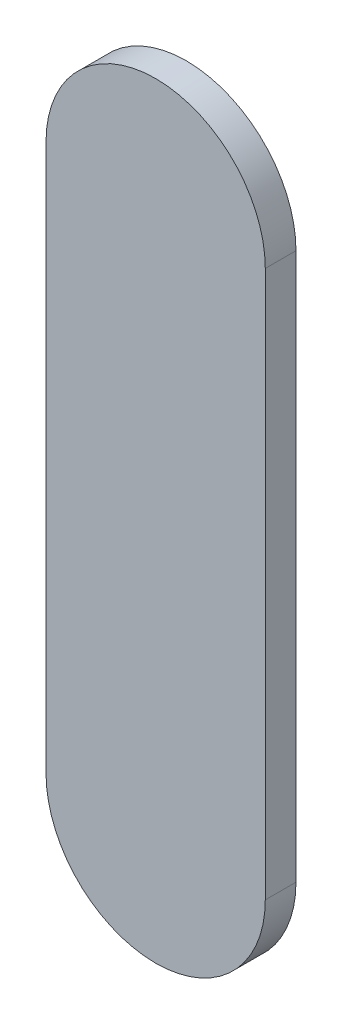
ISO-10303-21;
HEADER;
FILE_DESCRIPTION(('STEP AP214'),'2;1');
FILE_NAME('part.step','',(''),(''),'','','');
FILE_SCHEMA(('AUTOMOTIVE_DESIGN { 1 0 10303 214 1 1 1 1 }'));
ENDSEC;
DATA;
#1=APPLICATION_CONTEXT('core data for automotive mechanical design processes');
#2=APPLICATION_PROTOCOL_DEFINITION('international standard','automotive_design',2000,#1);
#3=PRODUCT_CONTEXT('',#1,'mechanical');
#4=PRODUCT('Part','Part','',(#3));
#5=PRODUCT_RELATED_PRODUCT_CATEGORY('part','',(#4));
#6=PRODUCT_DEFINITION_FORMATION('','',#4);
#7=PRODUCT_DEFINITION_CONTEXT('part definition',#1,'design');
#8=PRODUCT_DEFINITION('design','',#6,#7);
#9=PRODUCT_DEFINITION_SHAPE('','',#8);
#10=(LENGTH_UNIT() NAMED_UNIT(*) SI_UNIT(.MILLI.,.METRE.));
#11=(NAMED_UNIT(*) PLANE_ANGLE_UNIT() SI_UNIT($,.RADIAN.));
#12=(NAMED_UNIT(*) SI_UNIT($,.STERADIAN.) SOLID_ANGLE_UNIT());
#13=UNCERTAINTY_MEASURE_WITH_UNIT(LENGTH_MEASURE(1.E-05),#10,'distance_accuracy_value','');
#14=(GEOMETRIC_REPRESENTATION_CONTEXT(3) GLOBAL_UNCERTAINTY_ASSIGNED_CONTEXT((#13)) GLOBAL_UNIT_ASSIGNED_CONTEXT((#10,
#11,#12)) REPRESENTATION_CONTEXT('',''));
#15=CARTESIAN_POINT('',(0.,0.,0.));
#16=DIRECTION('',(0.,0.,1.));
#17=DIRECTION('',(1.,0.,0.));
#18=AXIS2_PLACEMENT_3D('',#15,#16,#17);
#19=CARTESIAN_POINT('',(87.7480084,92.25726024,0.));
#20=DIRECTION('',(-1.,0.,0.));
#21=DIRECTION('',(0.,1.,0.));
#22=AXIS2_PLACEMENT_3D('',#19,#20,#21);
#23=PLANE('',#22);
#24=DIRECTION('',(0.,1.,0.));
#25=VECTOR('',#24,1.);
#26=CARTESIAN_POINT('',(87.7480084,92.25726024,0.03556));
#27=LINE('',#26,#25);
#28=CARTESIAN_POINT('',(87.7480084,92.25726024,0.03556));
#29=VERTEX_POINT('',#28);
#30=CARTESIAN_POINT('',(87.7480084,92.89075656,0.03556));
#31=VERTEX_POINT('',#30);
#32=EDGE_CURVE('E11',#29,#31,#27,.T.);
#33=ORIENTED_EDGE('',*,*,#32,.F.);
#34=DIRECTION('',(0.,0.,1.));
#35=VECTOR('',#34,1.);
#36=CARTESIAN_POINT('',(87.7480084,92.25726024,0.));
#37=LINE('',#36,#35);
#38=CARTESIAN_POINT('',(87.7480084,92.25726024,0.));
#39=VERTEX_POINT('',#38);
#40=EDGE_CURVE('E24',#39,#29,#37,.T.);
#41=ORIENTED_EDGE('',*,*,#40,.F.);
#42=DIRECTION('',(0.,1.,0.));
#43=VECTOR('',#42,1.);
#44=CARTESIAN_POINT('',(87.7480084,92.25726024,0.));
#45=LINE('',#44,#43);
#46=CARTESIAN_POINT('',(87.7480084,92.89075656,0.));
#47=VERTEX_POINT('',#46);
#48=EDGE_CURVE('E75',#39,#47,#45,.T.);
#49=ORIENTED_EDGE('',*,*,#48,.T.);
#50=DIRECTION('',(0.,0.,1.));
#51=VECTOR('',#50,1.);
#52=CARTESIAN_POINT('',(87.7480084,92.89075656,0.));
#53=LINE('',#52,#51);
#54=EDGE_CURVE('E37',#47,#31,#53,.T.);
#55=ORIENTED_EDGE('',*,*,#54,.T.);
#56=EDGE_LOOP('',(#33,#41,#49,#55));
#57=FACE_BOUND('',#56,.T.);
#58=ADVANCED_FACE('F17',(#57),#23,.F.);
#59=CARTESIAN_POINT('',(87.6210084,92.89075656,0.));
#60=DIRECTION('',(0.,0.,-1.));
#61=DIRECTION('',(1.,0.,0.));
#62=AXIS2_PLACEMENT_3D('',#59,#60,#61);
#63=CYLINDRICAL_SURFACE('',#62,0.126999999999995);
#64=CARTESIAN_POINT('',(87.6210084,92.89075656,0.03556));
#65=DIRECTION('',(0.,0.,1.));
#66=DIRECTION('',(1.,0.,0.));
#67=AXIS2_PLACEMENT_3D('',#64,#65,#66);
#68=CIRCLE('',#67,0.126999999999995);
#69=CARTESIAN_POINT('',(87.4940084,92.89075656,0.03556));
#70=VERTEX_POINT('',#69);
#71=EDGE_CURVE('E83',#31,#70,#68,.T.);
#72=ORIENTED_EDGE('',*,*,#71,.F.);
#73=ORIENTED_EDGE('',*,*,#54,.F.);
#74=CARTESIAN_POINT('',(87.6210084,92.89075656,0.));
#75=DIRECTION('',(0.,0.,1.));
#76=DIRECTION('',(1.,0.,0.));
#77=AXIS2_PLACEMENT_3D('',#74,#75,#76);
#78=CIRCLE('',#77,0.126999999999995);
#79=CARTESIAN_POINT('',(87.4940084,92.89075656,0.));
#80=VERTEX_POINT('',#79);
#81=EDGE_CURVE('E81',#47,#80,#78,.T.);
#82=ORIENTED_EDGE('',*,*,#81,.T.);
#83=DIRECTION('',(0.,0.,1.));
#84=VECTOR('',#83,1.);
#85=CARTESIAN_POINT('',(87.4940084,92.89075656,0.));
#86=LINE('',#85,#84);
#87=EDGE_CURVE('E67',#80,#70,#86,.T.);
#88=ORIENTED_EDGE('',*,*,#87,.T.);
#89=EDGE_LOOP('',(#72,#73,#82,#88));
#90=FACE_BOUND('',#89,.T.);
#91=ADVANCED_FACE('F89',(#90),#63,.T.);
#92=CARTESIAN_POINT('',(87.4940084,92.89075656,0.));
#93=DIRECTION('',(1.,0.,0.));
#94=DIRECTION('',(0.,-1.,0.));
#95=AXIS2_PLACEMENT_3D('',#92,#93,#94);
#96=PLANE('',#95);
#97=DIRECTION('',(0.,-1.,0.));
#98=VECTOR('',#97,1.);
#99=CARTESIAN_POINT('',(87.4940084,92.89075656,0.03556));
#100=LINE('',#99,#98);
#101=CARTESIAN_POINT('',(87.4940084,92.25726024,0.03556));
#102=VERTEX_POINT('',#101);
#103=EDGE_CURVE('E71',#70,#102,#100,.T.);
#104=ORIENTED_EDGE('',*,*,#103,.F.);
#105=ORIENTED_EDGE('',*,*,#87,.F.);
#106=DIRECTION('',(0.,-1.,0.));
#107=VECTOR('',#106,1.);
#108=CARTESIAN_POINT('',(87.4940084,92.89075656,0.));
#109=LINE('',#108,#107);
#110=CARTESIAN_POINT('',(87.4940084,92.25726024,0.));
#111=VERTEX_POINT('',#110);
#112=EDGE_CURVE('E63',#80,#111,#109,.T.);
#113=ORIENTED_EDGE('',*,*,#112,.T.);
#114=DIRECTION('',(0.,0.,1.));
#115=VECTOR('',#114,1.);
#116=CARTESIAN_POINT('',(87.4940084,92.25726024,0.));
#117=LINE('',#116,#115);
#118=EDGE_CURVE('E53',#111,#102,#117,.T.);
#119=ORIENTED_EDGE('',*,*,#118,.T.);
#120=EDGE_LOOP('',(#104,#105,#113,#119));
#121=FACE_BOUND('',#120,.T.);
#122=ADVANCED_FACE('F66',(#121),#96,.F.);
#123=CARTESIAN_POINT('',(87.6210084,92.25726024,0.));
#124=DIRECTION('',(0.,0.,-1.));
#125=DIRECTION('',(-1.,0.,0.));
#126=AXIS2_PLACEMENT_3D('',#123,#124,#125);
#127=CYLINDRICAL_SURFACE('',#126,0.126999999999995);
#128=CARTESIAN_POINT('',(87.6210084,92.25726024,0.03556));
#129=DIRECTION('',(0.,0.,1.));
#130=DIRECTION('',(-1.,0.,0.));
#131=AXIS2_PLACEMENT_3D('',#128,#129,#130);
#132=CIRCLE('',#131,0.126999999999995);
#133=EDGE_CURVE('E59',#102,#29,#132,.T.);
#134=ORIENTED_EDGE('',*,*,#133,.F.);
#135=ORIENTED_EDGE('',*,*,#118,.F.);
#136=CARTESIAN_POINT('',(87.6210084,92.25726024,0.));
#137=DIRECTION('',(0.,0.,1.));
#138=DIRECTION('',(-1.,0.,0.));
#139=AXIS2_PLACEMENT_3D('',#136,#137,#138);
#140=CIRCLE('',#139,0.126999999999995);
#141=EDGE_CURVE('E57',#111,#39,#140,.T.);
#142=ORIENTED_EDGE('',*,*,#141,.T.);
#143=ORIENTED_EDGE('',*,*,#40,.T.);
#144=EDGE_LOOP('',(#134,#135,#142,#143));
#145=FACE_BOUND('',#144,.T.);
#146=ADVANCED_FACE('F55',(#145),#127,.T.);
#147=CARTESIAN_POINT('',(87.7480084,92.25726024,0.));
#148=DIRECTION('',(0.,0.,-1.));
#149=DIRECTION('',(-1.,0.,0.));
#150=AXIS2_PLACEMENT_3D('',#147,#148,#149);
#151=PLANE('',#150);
#152=ORIENTED_EDGE('',*,*,#141,.F.);
#153=ORIENTED_EDGE('',*,*,#112,.F.);
#154=ORIENTED_EDGE('',*,*,#81,.F.);
#155=ORIENTED_EDGE('',*,*,#48,.F.);
#156=EDGE_LOOP('',(#152,#153,#154,#155));
#157=FACE_BOUND('',#156,.T.);
#158=ADVANCED_FACE('F74',(#157),#151,.T.);
#159=CARTESIAN_POINT('',(87.7480084,92.25726024,0.03556));
#160=DIRECTION('',(0.,0.,-1.));
#161=DIRECTION('',(-1.,0.,0.));
#162=AXIS2_PLACEMENT_3D('',#159,#160,#161);
#163=PLANE('',#162);
#164=ORIENTED_EDGE('',*,*,#32,.T.);
#165=ORIENTED_EDGE('',*,*,#71,.T.);
#166=ORIENTED_EDGE('',*,*,#103,.T.);
#167=ORIENTED_EDGE('',*,*,#133,.T.);
#168=EDGE_LOOP('',(#164,#165,#166,#167));
#169=FACE_BOUND('',#168,.T.);
#170=ADVANCED_FACE('F91',(#169),#163,.F.);
#171=CLOSED_SHELL('',(#58,#91,#122,#146,#158,#170));
#172=MANIFOLD_SOLID_BREP('B1',#171);
#173=ADVANCED_BREP_SHAPE_REPRESENTATION('',(#18,#172),#14);
#174=SHAPE_DEFINITION_REPRESENTATION(#9,#173);
ENDSEC;
END-ISO-10303-21;
